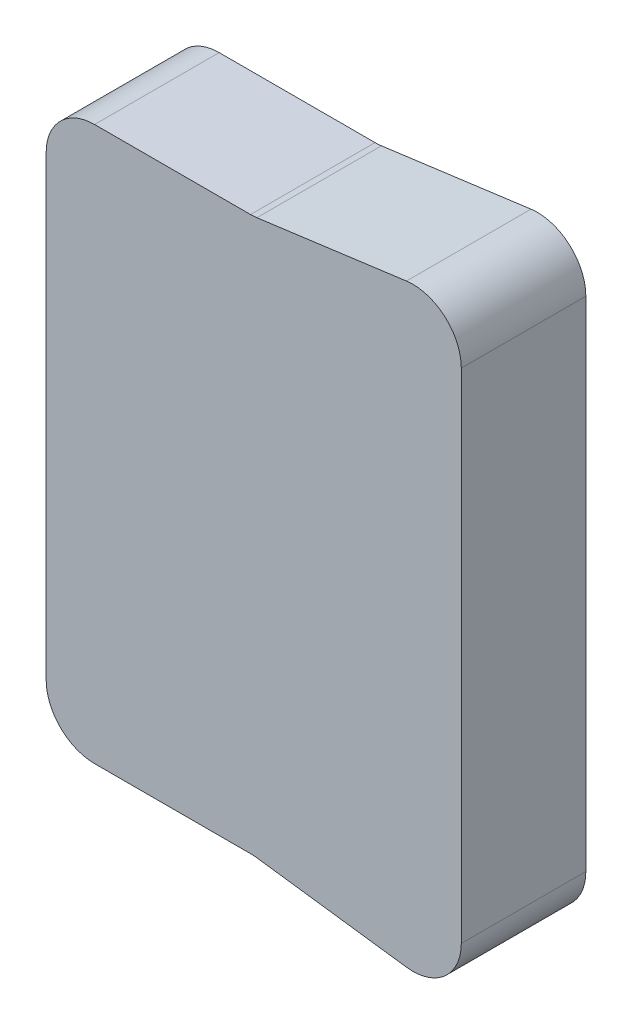
ISO-10303-21;
HEADER;
FILE_DESCRIPTION(('STEP AP214'),'2;1');
FILE_NAME('part.step','',(''),(''),'','','');
FILE_SCHEMA(('AUTOMOTIVE_DESIGN { 1 0 10303 214 1 1 1 1 }'));
ENDSEC;
DATA;
#1=APPLICATION_CONTEXT('core data for automotive mechanical design processes');
#2=APPLICATION_PROTOCOL_DEFINITION('international standard','automotive_design',2000,#1);
#3=PRODUCT_CONTEXT('',#1,'mechanical');
#4=PRODUCT('Part','Part','',(#3));
#5=PRODUCT_RELATED_PRODUCT_CATEGORY('part','',(#4));
#6=PRODUCT_DEFINITION_FORMATION('','',#4);
#7=PRODUCT_DEFINITION_CONTEXT('part definition',#1,'design');
#8=PRODUCT_DEFINITION('design','',#6,#7);
#9=PRODUCT_DEFINITION_SHAPE('','',#8);
#10=(LENGTH_UNIT() NAMED_UNIT(*) SI_UNIT(.MILLI.,.METRE.));
#11=(NAMED_UNIT(*) PLANE_ANGLE_UNIT() SI_UNIT($,.RADIAN.));
#12=(NAMED_UNIT(*) SI_UNIT($,.STERADIAN.) SOLID_ANGLE_UNIT());
#13=UNCERTAINTY_MEASURE_WITH_UNIT(LENGTH_MEASURE(1.E-05),#10,'distance_accuracy_value','');
#14=(GEOMETRIC_REPRESENTATION_CONTEXT(3) GLOBAL_UNCERTAINTY_ASSIGNED_CONTEXT((#13)) GLOBAL_UNIT_ASSIGNED_CONTEXT((#10,
#11,#12)) REPRESENTATION_CONTEXT('',''));
#15=CARTESIAN_POINT('',(0.,0.,0.));
#16=DIRECTION('',(0.,0.,1.));
#17=DIRECTION('',(1.,0.,0.));
#18=AXIS2_PLACEMENT_3D('',#15,#16,#17);
#19=CARTESIAN_POINT('',(0.,80.,18.));
#20=DIRECTION('',(1.,0.,0.));
#21=DIRECTION('',(0.,0.,-1.));
#22=AXIS2_PLACEMENT_3D('',#19,#20,#21);
#23=PLANE('',#22);
#24=DIRECTION('',(0.,-1.,0.));
#25=VECTOR('',#24,1.);
#26=CARTESIAN_POINT('',(0.,80.,0.));
#27=LINE('',#26,#25);
#28=CARTESIAN_POINT('',(0.,73.,0.));
#29=VERTEX_POINT('',#28);
#30=CARTESIAN_POINT('',(0.,7.00000000000001,0.));
#31=VERTEX_POINT('',#30);
#32=EDGE_CURVE('E153',#29,#31,#27,.T.);
#33=ORIENTED_EDGE('',*,*,#32,.T.);
#34=DIRECTION('',(0.,0.,-1.));
#35=VECTOR('',#34,1.);
#36=CARTESIAN_POINT('',(0.,7.00000000000001,18.));
#37=LINE('',#36,#35);
#38=CARTESIAN_POINT('',(0.,7.00000000000001,18.));
#39=VERTEX_POINT('',#38);
#40=EDGE_CURVE('E188',#31,#39,#37,.F.);
#41=ORIENTED_EDGE('',*,*,#40,.T.);
#42=DIRECTION('',(0.,-1.,0.));
#43=VECTOR('',#42,1.);
#44=CARTESIAN_POINT('',(0.,80.,18.));
#45=LINE('',#44,#43);
#46=CARTESIAN_POINT('',(0.,73.,18.));
#47=VERTEX_POINT('',#46);
#48=EDGE_CURVE('E162',#47,#39,#45,.T.);
#49=ORIENTED_EDGE('',*,*,#48,.F.);
#50=DIRECTION('',(0.,0.,-1.));
#51=VECTOR('',#50,1.);
#52=CARTESIAN_POINT('',(0.,73.,0.));
#53=LINE('',#52,#51);
#54=EDGE_CURVE('E185',#47,#29,#53,.T.);
#55=ORIENTED_EDGE('',*,*,#54,.T.);
#56=EDGE_LOOP('',(#33,#41,#49,#55));
#57=FACE_BOUND('',#56,.T.);
#58=ADVANCED_FACE('F32',(#57),#23,.F.);
#59=CARTESIAN_POINT('',(0.,0.,18.));
#60=DIRECTION('',(0.,1.,0.));
#61=DIRECTION('',(0.,0.,1.));
#62=AXIS2_PLACEMENT_3D('',#59,#60,#61);
#63=PLANE('',#62);
#64=DIRECTION('',(1.,0.,0.));
#65=VECTOR('',#64,1.);
#66=CARTESIAN_POINT('',(0.,0.,0.));
#67=LINE('',#66,#65);
#68=CARTESIAN_POINT('',(7.,0.,0.));
#69=VERTEX_POINT('',#68);
#70=CARTESIAN_POINT('',(29.5353891735246,0.,0.));
#71=VERTEX_POINT('',#70);
#72=EDGE_CURVE('E149',#69,#71,#67,.T.);
#73=ORIENTED_EDGE('',*,*,#72,.T.);
#74=DIRECTION('',(0.,0.,-1.));
#75=VECTOR('',#74,1.);
#76=CARTESIAN_POINT('',(29.5353891735246,0.,18.));
#77=LINE('',#76,#75);
#78=CARTESIAN_POINT('',(29.5353891735246,0.,18.));
#79=VERTEX_POINT('',#78);
#80=EDGE_CURVE('E127',#71,#79,#77,.F.);
#81=ORIENTED_EDGE('',*,*,#80,.T.);
#82=DIRECTION('',(1.,0.,0.));
#83=VECTOR('',#82,1.);
#84=CARTESIAN_POINT('',(0.,0.,18.));
#85=LINE('',#84,#83);
#86=CARTESIAN_POINT('',(7.,0.,18.));
#87=VERTEX_POINT('',#86);
#88=EDGE_CURVE('E237',#87,#79,#85,.T.);
#89=ORIENTED_EDGE('',*,*,#88,.F.);
#90=DIRECTION('',(0.,0.,-1.));
#91=VECTOR('',#90,1.);
#92=CARTESIAN_POINT('',(7.,0.,18.));
#93=LINE('',#92,#91);
#94=EDGE_CURVE('E142',#87,#69,#93,.T.);
#95=ORIENTED_EDGE('',*,*,#94,.T.);
#96=EDGE_LOOP('',(#73,#81,#89,#95));
#97=FACE_BOUND('',#96,.T.);
#98=ADVANCED_FACE('F239',(#97),#63,.F.);
#99=CARTESIAN_POINT('',(30.,0.,18.));
#100=DIRECTION('',(0.132163720091018,0.991227900682635,0.));
#101=DIRECTION('',(-0.991227900682635,0.132163720091018,0.));
#102=AXIS2_PLACEMENT_3D('',#99,#100,#101);
#103=PLANE('',#102);
#104=DIRECTION('',(0.991227900682635,-0.132163720091018,0.));
#105=VECTOR('',#104,1.);
#106=CARTESIAN_POINT('',(30.,0.,18.));
#107=LINE('',#106,#105);
#108=CARTESIAN_POINT('',(30.4605352141617,-0.0614046952215577,18.));
#109=VERTEX_POINT('',#108);
#110=CARTESIAN_POINT('',(52.0748539593629,-2.94331386124838,18.));
#111=VERTEX_POINT('',#110);
#112=EDGE_CURVE('E141',#109,#111,#107,.T.);
#113=ORIENTED_EDGE('',*,*,#112,.F.);
#114=DIRECTION('',(0.,0.,-1.));
#115=VECTOR('',#114,1.);
#116=CARTESIAN_POINT('',(30.4605352141617,-0.0614046952215578,0.));
#117=LINE('',#116,#115);
#118=CARTESIAN_POINT('',(30.4605352141617,-0.0614046952215577,0.));
#119=VERTEX_POINT('',#118);
#120=EDGE_CURVE('E126',#109,#119,#117,.T.);
#121=ORIENTED_EDGE('',*,*,#120,.T.);
#122=DIRECTION('',(0.991227900682635,-0.132163720091018,0.));
#123=VECTOR('',#122,1.);
#124=CARTESIAN_POINT('',(30.,0.,0.));
#125=LINE('',#124,#123);
#126=CARTESIAN_POINT('',(52.0748539593629,-2.94331386124838,0.));
#127=VERTEX_POINT('',#126);
#128=EDGE_CURVE('E139',#119,#127,#125,.T.);
#129=ORIENTED_EDGE('',*,*,#128,.T.);
#130=DIRECTION('',(0.,0.,-1.));
#131=VECTOR('',#130,1.);
#132=CARTESIAN_POINT('',(52.0748539593629,-2.94331386124838,18.));
#133=LINE('',#132,#131);
#134=EDGE_CURVE('E143',#127,#111,#133,.F.);
#135=ORIENTED_EDGE('',*,*,#134,.T.);
#136=EDGE_LOOP('',(#113,#121,#129,#135));
#137=FACE_BOUND('',#136,.T.);
#138=ADVANCED_FACE('F138',(#137),#103,.F.);
#139=CARTESIAN_POINT('',(60.,-4.,18.));
#140=DIRECTION('',(-1.,0.,0.));
#141=DIRECTION('',(0.,0.,1.));
#142=AXIS2_PLACEMENT_3D('',#139,#140,#141);
#143=PLANE('',#142);
#144=DIRECTION('',(0.,1.,0.));
#145=VECTOR('',#144,1.);
#146=CARTESIAN_POINT('',(60.,-4.,18.));
#147=LINE('',#146,#145);
#148=CARTESIAN_POINT('',(60.,3.99528144353006,18.));
#149=VERTEX_POINT('',#148);
#150=CARTESIAN_POINT('',(60.,76.0047185564699,18.));
#151=VERTEX_POINT('',#150);
#152=EDGE_CURVE('E222',#149,#151,#147,.T.);
#153=ORIENTED_EDGE('',*,*,#152,.F.);
#154=DIRECTION('',(0.,0.,-1.));
#155=VECTOR('',#154,1.);
#156=CARTESIAN_POINT('',(60.,3.99528144353006,18.));
#157=LINE('',#156,#155);
#158=CARTESIAN_POINT('',(60.,3.99528144353006,0.));
#159=VERTEX_POINT('',#158);
#160=EDGE_CURVE('E133',#149,#159,#157,.T.);
#161=ORIENTED_EDGE('',*,*,#160,.T.);
#162=DIRECTION('',(0.,1.,0.));
#163=VECTOR('',#162,1.);
#164=CARTESIAN_POINT('',(60.,-4.,0.));
#165=LINE('',#164,#163);
#166=CARTESIAN_POINT('',(60.,76.0047185564699,0.));
#167=VERTEX_POINT('',#166);
#168=EDGE_CURVE('E148',#159,#167,#165,.T.);
#169=ORIENTED_EDGE('',*,*,#168,.T.);
#170=DIRECTION('',(0.,0.,-1.));
#171=VECTOR('',#170,1.);
#172=CARTESIAN_POINT('',(60.,76.0047185564699,18.));
#173=LINE('',#172,#171);
#174=EDGE_CURVE('E47',#167,#151,#173,.F.);
#175=ORIENTED_EDGE('',*,*,#174,.T.);
#176=EDGE_LOOP('',(#153,#161,#169,#175));
#177=FACE_BOUND('',#176,.T.);
#178=ADVANCED_FACE('F247',(#177),#143,.F.);
#179=CARTESIAN_POINT('',(30.,80.,18.));
#180=DIRECTION('',(-0.132163720091018,0.991227900682635,0.));
#181=DIRECTION('',(-0.991227900682635,-0.132163720091018,0.));
#182=AXIS2_PLACEMENT_3D('',#179,#180,#181);
#183=PLANE('',#182);
#184=DIRECTION('',(0.991227900682635,0.132163720091018,0.));
#185=VECTOR('',#184,1.);
#186=CARTESIAN_POINT('',(30.,80.,0.));
#187=LINE('',#186,#185);
#188=CARTESIAN_POINT('',(30.4605352141617,80.0614046952216,0.));
#189=VERTEX_POINT('',#188);
#190=CARTESIAN_POINT('',(52.0748539593629,82.9433138612484,0.));
#191=VERTEX_POINT('',#190);
#192=EDGE_CURVE('E151',#189,#191,#187,.T.);
#193=ORIENTED_EDGE('',*,*,#192,.F.);
#194=DIRECTION('',(0.,0.,-1.));
#195=VECTOR('',#194,1.);
#196=CARTESIAN_POINT('',(30.4605352141617,80.0614046952216,18.));
#197=LINE('',#196,#195);
#198=CARTESIAN_POINT('',(30.4605352141617,80.0614046952216,18.));
#199=VERTEX_POINT('',#198);
#200=EDGE_CURVE('E176',#189,#199,#197,.F.);
#201=ORIENTED_EDGE('',*,*,#200,.T.);
#202=DIRECTION('',(0.991227900682635,0.132163720091018,0.));
#203=VECTOR('',#202,1.);
#204=CARTESIAN_POINT('',(30.,80.,18.));
#205=LINE('',#204,#203);
#206=CARTESIAN_POINT('',(52.0748539593629,82.9433138612484,18.));
#207=VERTEX_POINT('',#206);
#208=EDGE_CURVE('E217',#199,#207,#205,.T.);
#209=ORIENTED_EDGE('',*,*,#208,.T.);
#210=DIRECTION('',(0.,0.,-1.));
#211=VECTOR('',#210,1.);
#212=CARTESIAN_POINT('',(52.0748539593629,82.9433138612484,0.));
#213=LINE('',#212,#211);
#214=EDGE_CURVE('E173',#207,#191,#213,.T.);
#215=ORIENTED_EDGE('',*,*,#214,.T.);
#216=EDGE_LOOP('',(#193,#201,#209,#215));
#217=FACE_BOUND('',#216,.T.);
#218=ADVANCED_FACE('F206',(#217),#183,.T.);
#219=CARTESIAN_POINT('',(0.,80.,18.));
#220=DIRECTION('',(0.,1.,0.));
#221=DIRECTION('',(0.,0.,1.));
#222=AXIS2_PLACEMENT_3D('',#219,#220,#221);
#223=PLANE('',#222);
#224=DIRECTION('',(1.,0.,0.));
#225=VECTOR('',#224,1.);
#226=CARTESIAN_POINT('',(0.,80.,18.));
#227=LINE('',#226,#225);
#228=CARTESIAN_POINT('',(7.,80.,18.));
#229=VERTEX_POINT('',#228);
#230=CARTESIAN_POINT('',(29.5353891735246,80.,18.));
#231=VERTEX_POINT('',#230);
#232=EDGE_CURVE('E163',#229,#231,#227,.T.);
#233=ORIENTED_EDGE('',*,*,#232,.T.);
#234=DIRECTION('',(0.,0.,-1.));
#235=VECTOR('',#234,1.);
#236=CARTESIAN_POINT('',(29.5353891735246,80.,0.));
#237=LINE('',#236,#235);
#238=CARTESIAN_POINT('',(29.5353891735246,80.,0.));
#239=VERTEX_POINT('',#238);
#240=EDGE_CURVE('E170',#231,#239,#237,.T.);
#241=ORIENTED_EDGE('',*,*,#240,.T.);
#242=DIRECTION('',(1.,0.,0.));
#243=VECTOR('',#242,1.);
#244=CARTESIAN_POINT('',(0.,80.,0.));
#245=LINE('',#244,#243);
#246=CARTESIAN_POINT('',(7.,80.,0.));
#247=VERTEX_POINT('',#246);
#248=EDGE_CURVE('E159',#247,#239,#245,.T.);
#249=ORIENTED_EDGE('',*,*,#248,.F.);
#250=DIRECTION('',(0.,0.,-1.));
#251=VECTOR('',#250,1.);
#252=CARTESIAN_POINT('',(7.,80.,18.));
#253=LINE('',#252,#251);
#254=EDGE_CURVE('E168',#247,#229,#253,.F.);
#255=ORIENTED_EDGE('',*,*,#254,.T.);
#256=EDGE_LOOP('',(#233,#241,#249,#255));
#257=FACE_BOUND('',#256,.T.);
#258=ADVANCED_FACE('F219',(#257),#223,.T.);
#259=CARTESIAN_POINT('',(0.,0.,18.));
#260=DIRECTION('',(0.,0.,1.));
#261=DIRECTION('',(1.,0.,0.));
#262=AXIS2_PLACEMENT_3D('',#259,#260,#261);
#263=PLANE('',#262);
#264=ORIENTED_EDGE('',*,*,#48,.T.);
#265=CARTESIAN_POINT('',(7.,7.,18.));
#266=DIRECTION('',(0.,0.,1.));
#267=DIRECTION('',(1.,0.,0.));
#268=AXIS2_PLACEMENT_3D('',#265,#266,#267);
#269=CIRCLE('',#268,7.);
#270=EDGE_CURVE('E195',#39,#87,#269,.T.);
#271=ORIENTED_EDGE('',*,*,#270,.T.);
#272=ORIENTED_EDGE('',*,*,#88,.T.);
#273=CARTESIAN_POINT('',(29.5353891735246,-7.,18.));
#274=DIRECTION('',(0.,0.,1.));
#275=DIRECTION('',(1.,0.,0.));
#276=AXIS2_PLACEMENT_3D('',#273,#274,#275);
#277=CIRCLE('',#276,7.);
#278=EDGE_CURVE('E132',#79,#109,#277,.F.);
#279=ORIENTED_EDGE('',*,*,#278,.T.);
#280=ORIENTED_EDGE('',*,*,#112,.T.);
#281=CARTESIAN_POINT('',(53.,3.99528144353006,18.));
#282=DIRECTION('',(0.,0.,1.));
#283=DIRECTION('',(1.,0.,0.));
#284=AXIS2_PLACEMENT_3D('',#281,#282,#283);
#285=CIRCLE('',#284,7.);
#286=EDGE_CURVE('E54',#111,#149,#285,.T.);
#287=ORIENTED_EDGE('',*,*,#286,.T.);
#288=ORIENTED_EDGE('',*,*,#152,.T.);
#289=CARTESIAN_POINT('',(53.,76.0047185564699,18.));
#290=DIRECTION('',(0.,0.,1.));
#291=DIRECTION('',(1.,0.,0.));
#292=AXIS2_PLACEMENT_3D('',#289,#290,#291);
#293=CIRCLE('',#292,7.);
#294=EDGE_CURVE('E192',#151,#207,#293,.T.);
#295=ORIENTED_EDGE('',*,*,#294,.T.);
#296=ORIENTED_EDGE('',*,*,#208,.F.);
#297=CARTESIAN_POINT('',(29.5353891735246,87.,18.));
#298=DIRECTION('',(0.,0.,1.));
#299=DIRECTION('',(1.,0.,0.));
#300=AXIS2_PLACEMENT_3D('',#297,#298,#299);
#301=CIRCLE('',#300,7.);
#302=EDGE_CURVE('E11',#199,#231,#301,.F.);
#303=ORIENTED_EDGE('',*,*,#302,.T.);
#304=ORIENTED_EDGE('',*,*,#232,.F.);
#305=CARTESIAN_POINT('',(7.,73.,18.));
#306=DIRECTION('',(0.,0.,1.));
#307=DIRECTION('',(1.,0.,0.));
#308=AXIS2_PLACEMENT_3D('',#305,#306,#307);
#309=CIRCLE('',#308,7.);
#310=EDGE_CURVE('E190',#229,#47,#309,.T.);
#311=ORIENTED_EDGE('',*,*,#310,.T.);
#312=EDGE_LOOP('',(#264,#271,#272,#279,#280,#287,#288,#295,#296,#303,#304,#311));
#313=FACE_BOUND('',#312,.T.);
#314=ADVANCED_FACE('F215',(#313),#263,.T.);
#315=CARTESIAN_POINT('',(0.,0.,0.));
#316=DIRECTION('',(0.,0.,1.));
#317=DIRECTION('',(1.,0.,0.));
#318=AXIS2_PLACEMENT_3D('',#315,#316,#317);
#319=PLANE('',#318);
#320=ORIENTED_EDGE('',*,*,#72,.F.);
#321=CARTESIAN_POINT('',(7.,7.,0.));
#322=DIRECTION('',(0.,0.,1.));
#323=DIRECTION('',(1.,0.,0.));
#324=AXIS2_PLACEMENT_3D('',#321,#322,#323);
#325=CIRCLE('',#324,7.);
#326=EDGE_CURVE('E183',#69,#31,#325,.F.);
#327=ORIENTED_EDGE('',*,*,#326,.T.);
#328=ORIENTED_EDGE('',*,*,#32,.F.);
#329=CARTESIAN_POINT('',(7.,73.,0.));
#330=DIRECTION('',(0.,0.,1.));
#331=DIRECTION('',(1.,0.,0.));
#332=AXIS2_PLACEMENT_3D('',#329,#330,#331);
#333=CIRCLE('',#332,7.);
#334=EDGE_CURVE('E178',#29,#247,#333,.F.);
#335=ORIENTED_EDGE('',*,*,#334,.T.);
#336=ORIENTED_EDGE('',*,*,#248,.T.);
#337=CARTESIAN_POINT('',(29.5353891735246,87.,0.));
#338=DIRECTION('',(0.,0.,1.));
#339=DIRECTION('',(1.,0.,0.));
#340=AXIS2_PLACEMENT_3D('',#337,#338,#339);
#341=CIRCLE('',#340,7.);
#342=EDGE_CURVE('E40',#239,#189,#341,.T.);
#343=ORIENTED_EDGE('',*,*,#342,.T.);
#344=ORIENTED_EDGE('',*,*,#192,.T.);
#345=CARTESIAN_POINT('',(53.,76.0047185564699,0.));
#346=DIRECTION('',(0.,0.,1.));
#347=DIRECTION('',(1.,0.,0.));
#348=AXIS2_PLACEMENT_3D('',#345,#346,#347);
#349=CIRCLE('',#348,7.);
#350=EDGE_CURVE('E180',#191,#167,#349,.F.);
#351=ORIENTED_EDGE('',*,*,#350,.T.);
#352=ORIENTED_EDGE('',*,*,#168,.F.);
#353=CARTESIAN_POINT('',(53.,3.99528144353006,0.));
#354=DIRECTION('',(0.,0.,1.));
#355=DIRECTION('',(1.,0.,0.));
#356=AXIS2_PLACEMENT_3D('',#353,#354,#355);
#357=CIRCLE('',#356,7.);
#358=EDGE_CURVE('E147',#159,#127,#357,.F.);
#359=ORIENTED_EDGE('',*,*,#358,.T.);
#360=ORIENTED_EDGE('',*,*,#128,.F.);
#361=CARTESIAN_POINT('',(29.5353891735246,-7.,0.));
#362=DIRECTION('',(0.,0.,1.));
#363=DIRECTION('',(1.,0.,0.));
#364=AXIS2_PLACEMENT_3D('',#361,#362,#363);
#365=CIRCLE('',#364,7.);
#366=EDGE_CURVE('E122',#119,#71,#365,.T.);
#367=ORIENTED_EDGE('',*,*,#366,.T.);
#368=EDGE_LOOP('',(#320,#327,#328,#335,#336,#343,#344,#351,#352,#359,#360,#367));
#369=FACE_BOUND('',#368,.T.);
#370=ADVANCED_FACE('F145',(#369),#319,.F.);
#371=CARTESIAN_POINT('',(29.5353891735246,-7.,18.));
#372=DIRECTION('',(0.,0.,1.));
#373=DIRECTION('',(1.,0.,0.));
#374=AXIS2_PLACEMENT_3D('',#371,#372,#373);
#375=CYLINDRICAL_SURFACE('',#374,7.);
#376=ORIENTED_EDGE('',*,*,#278,.F.);
#377=ORIENTED_EDGE('',*,*,#80,.F.);
#378=ORIENTED_EDGE('',*,*,#366,.F.);
#379=ORIENTED_EDGE('',*,*,#120,.F.);
#380=EDGE_LOOP('',(#376,#377,#378,#379));
#381=FACE_BOUND('',#380,.T.);
#382=ADVANCED_FACE('F125',(#381),#375,.F.);
#383=CARTESIAN_POINT('',(29.5353891735246,87.,18.));
#384=DIRECTION('',(0.,0.,1.));
#385=DIRECTION('',(1.,0.,0.));
#386=AXIS2_PLACEMENT_3D('',#383,#384,#385);
#387=CYLINDRICAL_SURFACE('',#386,7.);
#388=ORIENTED_EDGE('',*,*,#302,.F.);
#389=ORIENTED_EDGE('',*,*,#200,.F.);
#390=ORIENTED_EDGE('',*,*,#342,.F.);
#391=ORIENTED_EDGE('',*,*,#240,.F.);
#392=EDGE_LOOP('',(#388,#389,#390,#391));
#393=FACE_BOUND('',#392,.T.);
#394=ADVANCED_FACE('F211',(#393),#387,.F.);
#395=CARTESIAN_POINT('',(7.,7.,18.));
#396=DIRECTION('',(0.,0.,-1.));
#397=DIRECTION('',(-1.,0.,0.));
#398=AXIS2_PLACEMENT_3D('',#395,#396,#397);
#399=CYLINDRICAL_SURFACE('',#398,7.);
#400=ORIENTED_EDGE('',*,*,#270,.F.);
#401=ORIENTED_EDGE('',*,*,#40,.F.);
#402=ORIENTED_EDGE('',*,*,#326,.F.);
#403=ORIENTED_EDGE('',*,*,#94,.F.);
#404=EDGE_LOOP('',(#400,#401,#402,#403));
#405=FACE_BOUND('',#404,.T.);
#406=ADVANCED_FACE('F233',(#405),#399,.T.);
#407=CARTESIAN_POINT('',(53.,3.99528144353006,18.));
#408=DIRECTION('',(0.,0.,-1.));
#409=DIRECTION('',(-1.,0.,0.));
#410=AXIS2_PLACEMENT_3D('',#407,#408,#409);
#411=CYLINDRICAL_SURFACE('',#410,7.);
#412=ORIENTED_EDGE('',*,*,#286,.F.);
#413=ORIENTED_EDGE('',*,*,#134,.F.);
#414=ORIENTED_EDGE('',*,*,#358,.F.);
#415=ORIENTED_EDGE('',*,*,#160,.F.);
#416=EDGE_LOOP('',(#412,#413,#414,#415));
#417=FACE_BOUND('',#416,.T.);
#418=ADVANCED_FACE('F249',(#417),#411,.T.);
#419=CARTESIAN_POINT('',(53.,76.0047185564699,18.));
#420=DIRECTION('',(0.,0.,1.));
#421=DIRECTION('',(1.,0.,0.));
#422=AXIS2_PLACEMENT_3D('',#419,#420,#421);
#423=CYLINDRICAL_SURFACE('',#422,7.);
#424=ORIENTED_EDGE('',*,*,#294,.F.);
#425=ORIENTED_EDGE('',*,*,#174,.F.);
#426=ORIENTED_EDGE('',*,*,#350,.F.);
#427=ORIENTED_EDGE('',*,*,#214,.F.);
#428=EDGE_LOOP('',(#424,#425,#426,#427));
#429=FACE_BOUND('',#428,.T.);
#430=ADVANCED_FACE('F246',(#429),#423,.T.);
#431=CARTESIAN_POINT('',(7.,73.,18.));
#432=DIRECTION('',(0.,0.,1.));
#433=DIRECTION('',(1.,0.,0.));
#434=AXIS2_PLACEMENT_3D('',#431,#432,#433);
#435=CYLINDRICAL_SURFACE('',#434,7.);
#436=ORIENTED_EDGE('',*,*,#310,.F.);
#437=ORIENTED_EDGE('',*,*,#254,.F.);
#438=ORIENTED_EDGE('',*,*,#334,.F.);
#439=ORIENTED_EDGE('',*,*,#54,.F.);
#440=EDGE_LOOP('',(#436,#437,#438,#439));
#441=FACE_BOUND('',#440,.T.);
#442=ADVANCED_FACE('F34',(#441),#435,.T.);
#443=CLOSED_SHELL('',(#58,#98,#138,#178,#218,#258,#314,#370,#382,#394,#406,#418,#430,#442));
#444=MANIFOLD_SOLID_BREP('B2',#443);
#445=ADVANCED_BREP_SHAPE_REPRESENTATION('',(#18,#444),#14);
#446=SHAPE_DEFINITION_REPRESENTATION(#9,#445);
ENDSEC;
END-ISO-10303-21;
